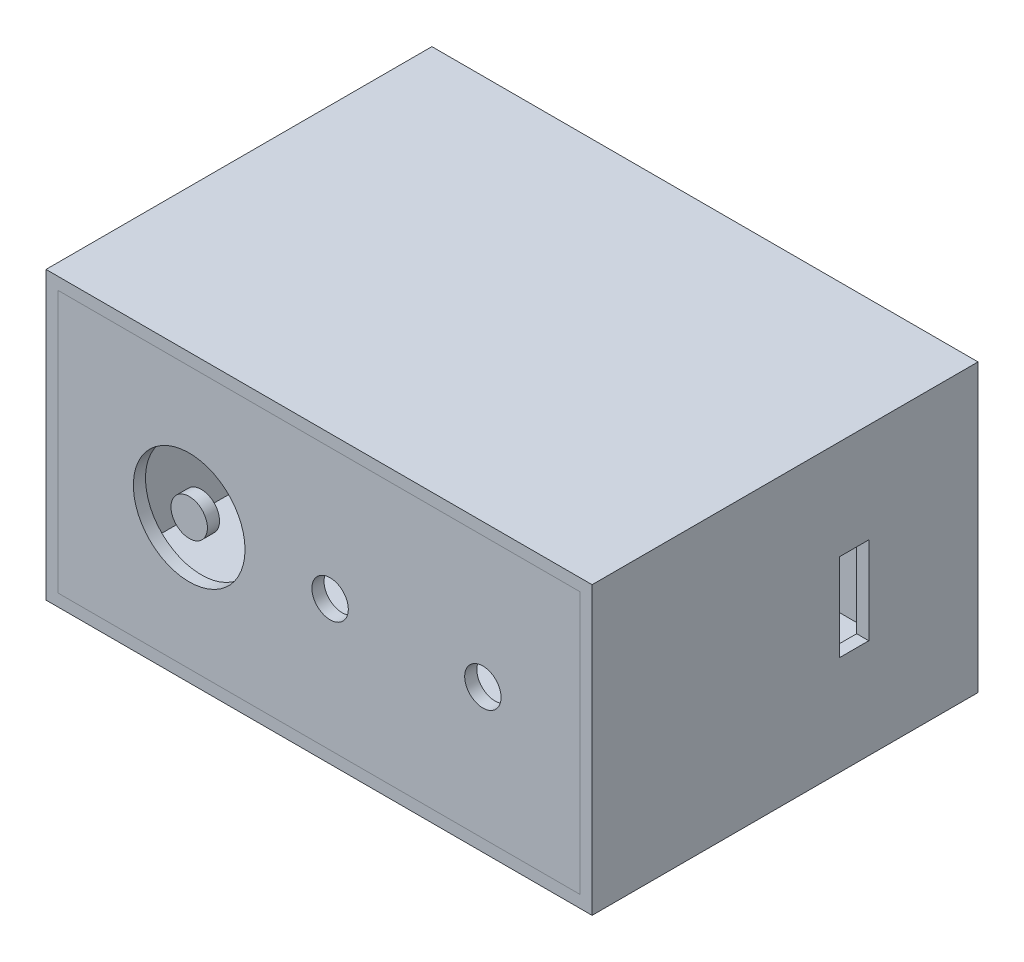
ISO-10303-21;
HEADER;
FILE_DESCRIPTION(('STEP AP214'),'2;1');
FILE_NAME('part.step','',(''),(''),'','','');
FILE_SCHEMA(('AUTOMOTIVE_DESIGN { 1 0 10303 214 1 1 1 1 }'));
ENDSEC;
DATA;
#1=APPLICATION_CONTEXT('core data for automotive mechanical design processes');
#2=APPLICATION_PROTOCOL_DEFINITION('international standard','automotive_design',2000,#1);
#3=PRODUCT_CONTEXT('',#1,'mechanical');
#4=PRODUCT('Part','Part','',(#3));
#5=PRODUCT_RELATED_PRODUCT_CATEGORY('part','',(#4));
#6=PRODUCT_DEFINITION_FORMATION('','',#4);
#7=PRODUCT_DEFINITION_CONTEXT('part definition',#1,'design');
#8=PRODUCT_DEFINITION('design','',#6,#7);
#9=PRODUCT_DEFINITION_SHAPE('','',#8);
#10=(LENGTH_UNIT() NAMED_UNIT(*) SI_UNIT(.MILLI.,.METRE.));
#11=(NAMED_UNIT(*) PLANE_ANGLE_UNIT() SI_UNIT($,.RADIAN.));
#12=(NAMED_UNIT(*) SI_UNIT($,.STERADIAN.) SOLID_ANGLE_UNIT());
#13=UNCERTAINTY_MEASURE_WITH_UNIT(LENGTH_MEASURE(1.E-05),#10,'distance_accuracy_value','');
#14=(GEOMETRIC_REPRESENTATION_CONTEXT(3) GLOBAL_UNCERTAINTY_ASSIGNED_CONTEXT((#13)) GLOBAL_UNIT_ASSIGNED_CONTEXT((#10,
#11,#12)) REPRESENTATION_CONTEXT('',''));
#15=CARTESIAN_POINT('',(0.,0.,0.));
#16=DIRECTION('',(0.,0.,1.));
#17=DIRECTION('',(1.,0.,0.));
#18=AXIS2_PLACEMENT_3D('',#15,#16,#17);
#19=CARTESIAN_POINT('',(0.,0.,15.4));
#20=DIRECTION('',(0.,0.,-1.));
#21=DIRECTION('',(-1.,0.,0.));
#22=AXIS2_PLACEMENT_3D('',#19,#20,#21);
#23=PLANE('',#22);
#24=CARTESIAN_POINT('',(-5.35,0.,15.4));
#25=DIRECTION('',(0.,0.,1.));
#26=DIRECTION('',(1.,0.,0.));
#27=AXIS2_PLACEMENT_3D('',#24,#25,#26);
#28=CIRCLE('',#27,0.750000000000002);
#29=CARTESIAN_POINT('',(-4.6,0.,15.4));
#30=VERTEX_POINT('',#29);
#31=EDGE_CURVE('P0_E18',#30,#30,#28,.T.);
#32=ORIENTED_EDGE('',*,*,#31,.F.);
#33=EDGE_LOOP('',(#32));
#34=FACE_BOUND('',#33,.T.);
#35=ADVANCED_FACE('P0_F15',(#34),#23,.T.);
#36=CARTESIAN_POINT('',(-5.35,0.,15.4));
#37=DIRECTION('',(0.,0.,1.));
#38=DIRECTION('',(1.,0.,0.));
#39=AXIS2_PLACEMENT_3D('',#36,#37,#38);
#40=CYLINDRICAL_SURFACE('',#39,0.750000000000002);
#41=CARTESIAN_POINT('',(-5.35,0.,15.9));
#42=DIRECTION('',(0.,0.,1.));
#43=DIRECTION('',(1.,0.,0.));
#44=AXIS2_PLACEMENT_3D('',#41,#42,#43);
#45=CIRCLE('',#44,0.750000000000002);
#46=CARTESIAN_POINT('',(-4.6,0.,15.9));
#47=VERTEX_POINT('',#46);
#48=EDGE_CURVE('P0_E10',#47,#47,#45,.F.);
#49=ORIENTED_EDGE('',*,*,#48,.T.);
#50=EDGE_LOOP('',(#49));
#51=FACE_BOUND('',#50,.T.);
#52=ORIENTED_EDGE('',*,*,#31,.T.);
#53=EDGE_LOOP('',(#52));
#54=FACE_BOUND('',#53,.T.);
#55=ADVANCED_FACE('P0_F27',(#51,#54),#40,.T.);
#56=CARTESIAN_POINT('',(0.,0.,15.9));
#57=DIRECTION('',(0.,0.,-1.));
#58=DIRECTION('',(-1.,0.,0.));
#59=AXIS2_PLACEMENT_3D('',#56,#57,#58);
#60=PLANE('',#59);
#61=ORIENTED_EDGE('',*,*,#48,.F.);
#62=EDGE_LOOP('',(#61));
#63=FACE_BOUND('',#62,.T.);
#64=ADVANCED_FACE('P0_F34',(#63),#60,.F.);
#65=CLOSED_SHELL('',(#35,#55,#64));
#66=MANIFOLD_SOLID_BREP('P0_B1',#65);
#67=CARTESIAN_POINT('',(0.,0.,15.9));
#68=DIRECTION('',(0.,0.,-1.));
#69=DIRECTION('',(-1.,0.,0.));
#70=AXIS2_PLACEMENT_3D('',#67,#68,#69);
#71=PLANE('',#70);
#72=DIRECTION('',(1.,0.,0.));
#73=VECTOR('',#72,1.);
#74=CARTESIAN_POINT('',(-10.75,5.4,15.9));
#75=LINE('',#74,#73);
#76=CARTESIAN_POINT('',(-10.75,5.4,15.9));
#77=VERTEX_POINT('',#76);
#78=CARTESIAN_POINT('',(10.75,5.4,15.9));
#79=VERTEX_POINT('',#78);
#80=EDGE_CURVE('P1_E208',#77,#79,#75,.T.);
#81=ORIENTED_EDGE('',*,*,#80,.F.);
#82=DIRECTION('',(0.,1.,0.));
#83=VECTOR('',#82,1.);
#84=CARTESIAN_POINT('',(-10.75,-5.4,15.9));
#85=LINE('',#84,#83);
#86=CARTESIAN_POINT('',(-10.75,-5.4,15.9));
#87=VERTEX_POINT('',#86);
#88=EDGE_CURVE('P1_E55',#87,#77,#85,.T.);
#89=ORIENTED_EDGE('',*,*,#88,.F.);
#90=DIRECTION('',(1.,0.,0.));
#91=VECTOR('',#90,1.);
#92=CARTESIAN_POINT('',(-10.75,-5.4,15.9));
#93=LINE('',#92,#91);
#94=CARTESIAN_POINT('',(10.75,-5.4,15.9));
#95=VERTEX_POINT('',#94);
#96=EDGE_CURVE('P1_E57',#95,#87,#93,.F.);
#97=ORIENTED_EDGE('',*,*,#96,.F.);
#98=DIRECTION('',(0.,1.,0.));
#99=VECTOR('',#98,1.);
#100=CARTESIAN_POINT('',(10.75,-5.4,15.9));
#101=LINE('',#100,#99);
#102=EDGE_CURVE('P1_E60',#79,#95,#101,.F.);
#103=ORIENTED_EDGE('',*,*,#102,.F.);
#104=EDGE_LOOP('',(#81,#89,#97,#103));
#105=FACE_BOUND('',#104,.T.);
#106=CARTESIAN_POINT('',(6.75,0.,15.9));
#107=DIRECTION('',(0.,0.,1.));
#108=DIRECTION('',(1.,0.,0.));
#109=AXIS2_PLACEMENT_3D('',#106,#107,#108);
#110=CIRCLE('',#109,0.749999999999999);
#111=CARTESIAN_POINT('',(7.5,0.,15.9));
#112=VERTEX_POINT('',#111);
#113=EDGE_CURVE('P1_E73',#112,#112,#110,.F.);
#114=ORIENTED_EDGE('',*,*,#113,.T.);
#115=EDGE_LOOP('',(#114));
#116=FACE_BOUND('',#115,.T.);
#117=CARTESIAN_POINT('',(-5.35,0.,15.9));
#118=DIRECTION('',(0.,0.,1.));
#119=DIRECTION('',(1.,0.,0.));
#120=AXIS2_PLACEMENT_3D('',#117,#118,#119);
#121=CIRCLE('',#120,2.29999999999999);
#122=CARTESIAN_POINT('',(-3.05000000000001,0.,15.9));
#123=VERTEX_POINT('',#122);
#124=EDGE_CURVE('P1_E95',#123,#123,#121,.F.);
#125=ORIENTED_EDGE('',*,*,#124,.T.);
#126=EDGE_LOOP('',(#125));
#127=FACE_BOUND('',#126,.T.);
#128=CARTESIAN_POINT('',(0.455450907590688,0.,15.9));
#129=DIRECTION('',(0.,0.,1.));
#130=DIRECTION('',(1.,0.,0.));
#131=AXIS2_PLACEMENT_3D('',#128,#129,#130);
#132=CIRCLE('',#131,0.75);
#133=CARTESIAN_POINT('',(1.20545090759069,0.,15.9));
#134=VERTEX_POINT('',#133);
#135=EDGE_CURVE('P1_E20',#134,#134,#132,.F.);
#136=ORIENTED_EDGE('',*,*,#135,.T.);
#137=EDGE_LOOP('',(#136));
#138=FACE_BOUND('',#137,.T.);
#139=ADVANCED_FACE('P1_F17',(#105,#116,#127,#138),#71,.F.);
#140=CARTESIAN_POINT('',(0.455450907590688,0.,15.4));
#141=DIRECTION('',(0.,0.,1.));
#142=DIRECTION('',(1.,0.,0.));
#143=AXIS2_PLACEMENT_3D('',#140,#141,#142);
#144=CYLINDRICAL_SURFACE('',#143,0.75);
#145=ORIENTED_EDGE('',*,*,#135,.F.);
#146=EDGE_LOOP('',(#145));
#147=FACE_BOUND('',#146,.T.);
#148=CARTESIAN_POINT('',(0.455450907590688,0.,15.4));
#149=DIRECTION('',(0.,0.,1.));
#150=DIRECTION('',(1.,0.,0.));
#151=AXIS2_PLACEMENT_3D('',#148,#149,#150);
#152=CIRCLE('',#151,0.75);
#153=CARTESIAN_POINT('',(1.20545090759069,0.,15.4));
#154=VERTEX_POINT('',#153);
#155=EDGE_CURVE('P1_E91',#154,#154,#152,.T.);
#156=ORIENTED_EDGE('',*,*,#155,.F.);
#157=EDGE_LOOP('',(#156));
#158=FACE_BOUND('',#157,.T.);
#159=ADVANCED_FACE('P1_F103',(#147,#158),#144,.F.);
#160=CARTESIAN_POINT('',(-5.35,0.,15.4));
#161=DIRECTION('',(0.,0.,1.));
#162=DIRECTION('',(1.,0.,0.));
#163=AXIS2_PLACEMENT_3D('',#160,#161,#162);
#164=CYLINDRICAL_SURFACE('',#163,2.29999999999999);
#165=ORIENTED_EDGE('',*,*,#124,.F.);
#166=EDGE_LOOP('',(#165));
#167=FACE_BOUND('',#166,.T.);
#168=CARTESIAN_POINT('',(-5.35,0.,15.4));
#169=DIRECTION('',(0.,0.,1.));
#170=DIRECTION('',(1.,0.,0.));
#171=AXIS2_PLACEMENT_3D('',#168,#169,#170);
#172=CIRCLE('',#171,2.29999999999999);
#173=CARTESIAN_POINT('',(-3.05000000000001,0.,15.4));
#174=VERTEX_POINT('',#173);
#175=EDGE_CURVE('P1_E88',#174,#174,#172,.T.);
#176=ORIENTED_EDGE('',*,*,#175,.F.);
#177=EDGE_LOOP('',(#176));
#178=FACE_BOUND('',#177,.T.);
#179=ADVANCED_FACE('P1_F106',(#167,#178),#164,.F.);
#180=CARTESIAN_POINT('',(6.75,0.,15.4));
#181=DIRECTION('',(0.,0.,1.));
#182=DIRECTION('',(1.,0.,0.));
#183=AXIS2_PLACEMENT_3D('',#180,#181,#182);
#184=CYLINDRICAL_SURFACE('',#183,0.749999999999999);
#185=ORIENTED_EDGE('',*,*,#113,.F.);
#186=EDGE_LOOP('',(#185));
#187=FACE_BOUND('',#186,.T.);
#188=CARTESIAN_POINT('',(6.75,0.,15.4));
#189=DIRECTION('',(0.,0.,1.));
#190=DIRECTION('',(1.,0.,0.));
#191=AXIS2_PLACEMENT_3D('',#188,#189,#190);
#192=CIRCLE('',#191,0.749999999999999);
#193=CARTESIAN_POINT('',(7.5,0.,15.4));
#194=VERTEX_POINT('',#193);
#195=EDGE_CURVE('P1_E84',#194,#194,#192,.T.);
#196=ORIENTED_EDGE('',*,*,#195,.F.);
#197=EDGE_LOOP('',(#196));
#198=FACE_BOUND('',#197,.T.);
#199=ADVANCED_FACE('P1_F130',(#187,#198),#184,.F.);
#200=CARTESIAN_POINT('',(10.75,-5.4,15.4));
#201=DIRECTION('',(1.,0.,0.));
#202=DIRECTION('',(0.,0.,-1.));
#203=AXIS2_PLACEMENT_3D('',#200,#201,#202);
#204=PLANE('',#203);
#205=DIRECTION('',(0.,1.,0.));
#206=VECTOR('',#205,1.);
#207=CARTESIAN_POINT('',(10.75,0.,15.4));
#208=LINE('',#207,#206);
#209=CARTESIAN_POINT('',(10.75,5.4,15.4));
#210=VERTEX_POINT('',#209);
#211=CARTESIAN_POINT('',(10.75,-5.4,15.4));
#212=VERTEX_POINT('',#211);
#213=EDGE_CURVE('P1_E87',#210,#212,#208,.F.);
#214=ORIENTED_EDGE('',*,*,#213,.F.);
#215=DIRECTION('',(0.,0.,1.));
#216=VECTOR('',#215,1.);
#217=CARTESIAN_POINT('',(10.75,5.4,15.4));
#218=LINE('',#217,#216);
#219=EDGE_CURVE('P1_E71',#79,#210,#218,.F.);
#220=ORIENTED_EDGE('',*,*,#219,.F.);
#221=ORIENTED_EDGE('',*,*,#102,.T.);
#222=DIRECTION('',(0.,0.,-1.));
#223=VECTOR('',#222,1.);
#224=CARTESIAN_POINT('',(10.75,-5.4,15.4));
#225=LINE('',#224,#223);
#226=EDGE_CURVE('P1_E65',#212,#95,#225,.F.);
#227=ORIENTED_EDGE('',*,*,#226,.F.);
#228=EDGE_LOOP('',(#214,#220,#221,#227));
#229=FACE_BOUND('',#228,.T.);
#230=ADVANCED_FACE('P1_F68',(#229),#204,.T.);
#231=CARTESIAN_POINT('',(-10.75,-5.4,15.4));
#232=DIRECTION('',(0.,-1.,0.));
#233=DIRECTION('',(0.,0.,-1.));
#234=AXIS2_PLACEMENT_3D('',#231,#232,#233);
#235=PLANE('',#234);
#236=DIRECTION('',(-1.,0.,0.));
#237=VECTOR('',#236,1.);
#238=CARTESIAN_POINT('',(0.,-5.4,15.4));
#239=LINE('',#238,#237);
#240=CARTESIAN_POINT('',(-10.75,-5.4,15.4));
#241=VERTEX_POINT('',#240);
#242=EDGE_CURVE('P1_E77',#212,#241,#239,.T.);
#243=ORIENTED_EDGE('',*,*,#242,.F.);
#244=ORIENTED_EDGE('',*,*,#226,.T.);
#245=ORIENTED_EDGE('',*,*,#96,.T.);
#246=DIRECTION('',(0.,0.,1.));
#247=VECTOR('',#246,1.);
#248=CARTESIAN_POINT('',(-10.75,-5.4,15.4));
#249=LINE('',#248,#247);
#250=EDGE_CURVE('P1_E80',#241,#87,#249,.T.);
#251=ORIENTED_EDGE('',*,*,#250,.F.);
#252=EDGE_LOOP('',(#243,#244,#245,#251));
#253=FACE_BOUND('',#252,.T.);
#254=ADVANCED_FACE('P1_F75',(#253),#235,.T.);
#255=CARTESIAN_POINT('',(-10.75,-5.4,15.4));
#256=DIRECTION('',(-1.,0.,0.));
#257=DIRECTION('',(0.,0.,1.));
#258=AXIS2_PLACEMENT_3D('',#255,#256,#257);
#259=PLANE('',#258);
#260=DIRECTION('',(0.,1.,0.));
#261=VECTOR('',#260,1.);
#262=CARTESIAN_POINT('',(-10.75,0.,15.4));
#263=LINE('',#262,#261);
#264=CARTESIAN_POINT('',(-10.75,5.4,15.4));
#265=VERTEX_POINT('',#264);
#266=EDGE_CURVE('P1_E26',#241,#265,#263,.T.);
#267=ORIENTED_EDGE('',*,*,#266,.F.);
#268=ORIENTED_EDGE('',*,*,#250,.T.);
#269=ORIENTED_EDGE('',*,*,#88,.T.);
#270=DIRECTION('',(0.,0.,1.));
#271=VECTOR('',#270,1.);
#272=CARTESIAN_POINT('',(-10.75,5.4,15.4));
#273=LINE('',#272,#271);
#274=EDGE_CURVE('P1_E35',#265,#77,#273,.T.);
#275=ORIENTED_EDGE('',*,*,#274,.F.);
#276=EDGE_LOOP('',(#267,#268,#269,#275));
#277=FACE_BOUND('',#276,.T.);
#278=ADVANCED_FACE('P1_F118',(#277),#259,.T.);
#279=CARTESIAN_POINT('',(-10.75,5.4,15.4));
#280=DIRECTION('',(0.,1.,0.));
#281=DIRECTION('',(0.,0.,1.));
#282=AXIS2_PLACEMENT_3D('',#279,#280,#281);
#283=PLANE('',#282);
#284=DIRECTION('',(-1.,0.,0.));
#285=VECTOR('',#284,1.);
#286=CARTESIAN_POINT('',(0.,5.4,15.4));
#287=LINE('',#286,#285);
#288=EDGE_CURVE('P1_E11',#265,#210,#287,.F.);
#289=ORIENTED_EDGE('',*,*,#288,.F.);
#290=ORIENTED_EDGE('',*,*,#274,.T.);
#291=ORIENTED_EDGE('',*,*,#80,.T.);
#292=ORIENTED_EDGE('',*,*,#219,.T.);
#293=EDGE_LOOP('',(#289,#290,#291,#292));
#294=FACE_BOUND('',#293,.T.);
#295=ADVANCED_FACE('P1_F111',(#294),#283,.T.);
#296=CARTESIAN_POINT('',(0.,0.,15.4));
#297=DIRECTION('',(0.,0.,-1.));
#298=DIRECTION('',(-1.,0.,0.));
#299=AXIS2_PLACEMENT_3D('',#296,#297,#298);
#300=PLANE('',#299);
#301=ORIENTED_EDGE('',*,*,#266,.T.);
#302=ORIENTED_EDGE('',*,*,#288,.T.);
#303=ORIENTED_EDGE('',*,*,#213,.T.);
#304=ORIENTED_EDGE('',*,*,#242,.T.);
#305=EDGE_LOOP('',(#301,#302,#303,#304));
#306=FACE_BOUND('',#305,.T.);
#307=ORIENTED_EDGE('',*,*,#195,.T.);
#308=EDGE_LOOP('',(#307));
#309=FACE_BOUND('',#308,.T.);
#310=ORIENTED_EDGE('',*,*,#175,.T.);
#311=EDGE_LOOP('',(#310));
#312=FACE_BOUND('',#311,.T.);
#313=ORIENTED_EDGE('',*,*,#155,.T.);
#314=EDGE_LOOP('',(#313));
#315=FACE_BOUND('',#314,.T.);
#316=ADVANCED_FACE('P1_F109',(#306,#309,#312,#315),#300,.T.);
#317=CLOSED_SHELL('',(#139,#159,#179,#199,#230,#254,#278,#295,#316));
#318=MANIFOLD_SOLID_BREP('P1_B1',#317);
#319=CARTESIAN_POINT('',(0.,0.,0.5));
#320=DIRECTION('',(0.,0.,-1.));
#321=DIRECTION('',(-1.,0.,0.));
#322=AXIS2_PLACEMENT_3D('',#319,#320,#321);
#323=PLANE('',#322);
#324=DIRECTION('',(1.,0.,0.));
#325=VECTOR('',#324,1.);
#326=CARTESIAN_POINT('',(-11.25,5.4,0.5));
#327=LINE('',#326,#325);
#328=CARTESIAN_POINT('',(-10.75,5.4,0.5));
#329=VERTEX_POINT('',#328);
#330=CARTESIAN_POINT('',(10.75,5.4,0.5));
#331=VERTEX_POINT('',#330);
#332=EDGE_CURVE('P2_E116',#329,#331,#327,.T.);
#333=ORIENTED_EDGE('',*,*,#332,.F.);
#334=DIRECTION('',(0.,1.,0.));
#335=VECTOR('',#334,1.);
#336=CARTESIAN_POINT('',(-10.75,-5.9,0.5));
#337=LINE('',#336,#335);
#338=CARTESIAN_POINT('',(-10.75,-5.4,0.5));
#339=VERTEX_POINT('',#338);
#340=EDGE_CURVE('P2_E107',#339,#329,#337,.T.);
#341=ORIENTED_EDGE('',*,*,#340,.F.);
#342=DIRECTION('',(1.,0.,0.));
#343=VECTOR('',#342,1.);
#344=CARTESIAN_POINT('',(-11.25,-5.4,0.5));
#345=LINE('',#344,#343);
#346=CARTESIAN_POINT('',(10.75,-5.4,0.5));
#347=VERTEX_POINT('',#346);
#348=EDGE_CURVE('P2_E102',#347,#339,#345,.F.);
#349=ORIENTED_EDGE('',*,*,#348,.F.);
#350=DIRECTION('',(0.,1.,0.));
#351=VECTOR('',#350,1.);
#352=CARTESIAN_POINT('',(10.75,-5.9,0.5));
#353=LINE('',#352,#351);
#354=EDGE_CURVE('P2_E119',#331,#347,#353,.F.);
#355=ORIENTED_EDGE('',*,*,#354,.F.);
#356=EDGE_LOOP('',(#333,#341,#349,#355));
#357=FACE_BOUND('',#356,.T.);
#358=ADVANCED_FACE('P2_F17',(#357),#323,.F.);
#359=CARTESIAN_POINT('',(6.35,-1.8,5.7));
#360=DIRECTION('',(0.,0.,1.));
#361=DIRECTION('',(1.,0.,0.));
#362=AXIS2_PLACEMENT_3D('',#359,#360,#361);
#363=PLANE('',#362);
#364=DIRECTION('',(1.,0.,0.));
#365=VECTOR('',#364,1.);
#366=CARTESIAN_POINT('',(6.35,1.8,5.7));
#367=LINE('',#366,#365);
#368=CARTESIAN_POINT('',(10.75,1.8,5.7));
#369=VERTEX_POINT('',#368);
#370=CARTESIAN_POINT('',(11.25,1.8,5.7));
#371=VERTEX_POINT('',#370);
#372=EDGE_CURVE('P2_E134',#369,#371,#367,.T.);
#373=ORIENTED_EDGE('',*,*,#372,.T.);
#374=DIRECTION('',(0.,1.,0.));
#375=VECTOR('',#374,1.);
#376=CARTESIAN_POINT('',(11.25,-5.9,5.7));
#377=LINE('',#376,#375);
#378=CARTESIAN_POINT('',(11.25,-1.8,5.7));
#379=VERTEX_POINT('',#378);
#380=EDGE_CURVE('P2_E147',#371,#379,#377,.F.);
#381=ORIENTED_EDGE('',*,*,#380,.T.);
#382=DIRECTION('',(1.,0.,0.));
#383=VECTOR('',#382,1.);
#384=CARTESIAN_POINT('',(6.35,-1.8,5.7));
#385=LINE('',#384,#383);
#386=CARTESIAN_POINT('',(10.75,-1.8,5.7));
#387=VERTEX_POINT('',#386);
#388=EDGE_CURVE('P2_E20',#379,#387,#385,.F.);
#389=ORIENTED_EDGE('',*,*,#388,.T.);
#390=DIRECTION('',(0.,1.,0.));
#391=VECTOR('',#390,1.);
#392=CARTESIAN_POINT('',(10.75,-5.9,5.7));
#393=LINE('',#392,#391);
#394=EDGE_CURVE('P2_E146',#369,#387,#393,.F.);
#395=ORIENTED_EDGE('',*,*,#394,.F.);
#396=EDGE_LOOP('',(#373,#381,#389,#395));
#397=FACE_BOUND('',#396,.T.);
#398=ADVANCED_FACE('P2_F145',(#397),#363,.F.);
#399=CARTESIAN_POINT('',(6.35,-1.8,5.7));
#400=DIRECTION('',(0.,-1.,0.));
#401=DIRECTION('',(0.,0.,-1.));
#402=AXIS2_PLACEMENT_3D('',#399,#400,#401);
#403=PLANE('',#402);
#404=ORIENTED_EDGE('',*,*,#388,.F.);
#405=DIRECTION('',(0.,0.,1.));
#406=VECTOR('',#405,1.);
#407=CARTESIAN_POINT('',(11.25,-1.8,15.9));
#408=LINE('',#407,#406);
#409=CARTESIAN_POINT('',(11.25,-1.8,4.5));
#410=VERTEX_POINT('',#409);
#411=EDGE_CURVE('P2_E193',#379,#410,#408,.F.);
#412=ORIENTED_EDGE('',*,*,#411,.T.);
#413=DIRECTION('',(-1.,0.,0.));
#414=VECTOR('',#413,1.);
#415=CARTESIAN_POINT('',(6.35,-1.8,4.5));
#416=LINE('',#415,#414);
#417=CARTESIAN_POINT('',(10.75,-1.8,4.5));
#418=VERTEX_POINT('',#417);
#419=EDGE_CURVE('P2_E136',#410,#418,#416,.T.);
#420=ORIENTED_EDGE('',*,*,#419,.T.);
#421=DIRECTION('',(0.,0.,1.));
#422=VECTOR('',#421,1.);
#423=CARTESIAN_POINT('',(10.75,-1.8,15.9));
#424=LINE('',#423,#422);
#425=EDGE_CURVE('P2_E149',#387,#418,#424,.F.);
#426=ORIENTED_EDGE('',*,*,#425,.F.);
#427=EDGE_LOOP('',(#404,#412,#420,#426));
#428=FACE_BOUND('',#427,.T.);
#429=ADVANCED_FACE('P2_F150',(#428),#403,.F.);
#430=CARTESIAN_POINT('',(6.35,-1.8,4.5));
#431=DIRECTION('',(0.,0.,-1.));
#432=DIRECTION('',(-1.,0.,0.));
#433=AXIS2_PLACEMENT_3D('',#430,#431,#432);
#434=PLANE('',#433);
#435=ORIENTED_EDGE('',*,*,#419,.F.);
#436=DIRECTION('',(0.,1.,0.));
#437=VECTOR('',#436,1.);
#438=CARTESIAN_POINT('',(11.25,-5.9,4.5));
#439=LINE('',#438,#437);
#440=CARTESIAN_POINT('',(11.25,1.8,4.5));
#441=VERTEX_POINT('',#440);
#442=EDGE_CURVE('P2_E190',#410,#441,#439,.T.);
#443=ORIENTED_EDGE('',*,*,#442,.T.);
#444=DIRECTION('',(1.,0.,0.));
#445=VECTOR('',#444,1.);
#446=CARTESIAN_POINT('',(6.35,1.8,4.5));
#447=LINE('',#446,#445);
#448=CARTESIAN_POINT('',(10.75,1.8,4.5));
#449=VERTEX_POINT('',#448);
#450=EDGE_CURVE('P2_E123',#441,#449,#447,.F.);
#451=ORIENTED_EDGE('',*,*,#450,.T.);
#452=DIRECTION('',(0.,1.,0.));
#453=VECTOR('',#452,1.);
#454=CARTESIAN_POINT('',(10.75,-5.9,4.5));
#455=LINE('',#454,#453);
#456=EDGE_CURVE('P2_E162',#418,#449,#455,.T.);
#457=ORIENTED_EDGE('',*,*,#456,.F.);
#458=EDGE_LOOP('',(#435,#443,#451,#457));
#459=FACE_BOUND('',#458,.T.);
#460=ADVANCED_FACE('P2_F261',(#459),#434,.F.);
#461=CARTESIAN_POINT('',(6.35,1.8,5.7));
#462=DIRECTION('',(0.,1.,0.));
#463=DIRECTION('',(0.,0.,1.));
#464=AXIS2_PLACEMENT_3D('',#461,#462,#463);
#465=PLANE('',#464);
#466=ORIENTED_EDGE('',*,*,#450,.F.);
#467=DIRECTION('',(0.,0.,1.));
#468=VECTOR('',#467,1.);
#469=CARTESIAN_POINT('',(11.25,1.8,15.9));
#470=LINE('',#469,#468);
#471=EDGE_CURVE('P2_E187',#441,#371,#470,.T.);
#472=ORIENTED_EDGE('',*,*,#471,.T.);
#473=ORIENTED_EDGE('',*,*,#372,.F.);
#474=DIRECTION('',(0.,0.,1.));
#475=VECTOR('',#474,1.);
#476=CARTESIAN_POINT('',(10.75,1.8,15.9));
#477=LINE('',#476,#475);
#478=EDGE_CURVE('P2_E156',#449,#369,#477,.T.);
#479=ORIENTED_EDGE('',*,*,#478,.F.);
#480=EDGE_LOOP('',(#466,#472,#473,#479));
#481=FACE_BOUND('',#480,.T.);
#482=ADVANCED_FACE('P2_F258',(#481),#465,.F.);
#483=CARTESIAN_POINT('',(-11.25,5.4,15.9));
#484=DIRECTION('',(0.,-1.,0.));
#485=DIRECTION('',(0.,0.,-1.));
#486=AXIS2_PLACEMENT_3D('',#483,#484,#485);
#487=PLANE('',#486);
#488=DIRECTION('',(-1.,0.,0.));
#489=VECTOR('',#488,1.);
#490=CARTESIAN_POINT('',(0.,5.4,15.9));
#491=LINE('',#490,#489);
#492=CARTESIAN_POINT('',(10.75,5.4,15.9));
#493=VERTEX_POINT('',#492);
#494=CARTESIAN_POINT('',(-10.75,5.4,15.9));
#495=VERTEX_POINT('',#494);
#496=EDGE_CURVE('P2_E127',#493,#495,#491,.T.);
#497=ORIENTED_EDGE('',*,*,#496,.T.);
#498=DIRECTION('',(0.,0.,-1.));
#499=VECTOR('',#498,1.);
#500=CARTESIAN_POINT('',(-10.75,5.4,15.9));
#501=LINE('',#500,#499);
#502=EDGE_CURVE('P2_E112',#329,#495,#501,.F.);
#503=ORIENTED_EDGE('',*,*,#502,.F.);
#504=ORIENTED_EDGE('',*,*,#332,.T.);
#505=DIRECTION('',(0.,0.,1.));
#506=VECTOR('',#505,1.);
#507=CARTESIAN_POINT('',(10.75,5.4,15.9));
#508=LINE('',#507,#506);
#509=EDGE_CURVE('P2_E196',#493,#331,#508,.F.);
#510=ORIENTED_EDGE('',*,*,#509,.F.);
#511=EDGE_LOOP('',(#497,#503,#504,#510));
#512=FACE_BOUND('',#511,.T.);
#513=ADVANCED_FACE('P2_F126',(#512),#487,.T.);
#514=CARTESIAN_POINT('',(-10.75,-5.9,15.9));
#515=DIRECTION('',(1.,0.,0.));
#516=DIRECTION('',(0.,0.,-1.));
#517=AXIS2_PLACEMENT_3D('',#514,#515,#516);
#518=PLANE('',#517);
#519=DIRECTION('',(0.,1.,0.));
#520=VECTOR('',#519,1.);
#521=CARTESIAN_POINT('',(-10.75,0.,15.9));
#522=LINE('',#521,#520);
#523=CARTESIAN_POINT('',(-10.75,-5.4,15.9));
#524=VERTEX_POINT('',#523);
#525=EDGE_CURVE('P2_E171',#495,#524,#522,.F.);
#526=ORIENTED_EDGE('',*,*,#525,.T.);
#527=DIRECTION('',(0.,0.,1.));
#528=VECTOR('',#527,1.);
#529=CARTESIAN_POINT('',(-10.75,-5.4,15.9));
#530=LINE('',#529,#528);
#531=EDGE_CURVE('P2_E114',#339,#524,#530,.T.);
#532=ORIENTED_EDGE('',*,*,#531,.F.);
#533=ORIENTED_EDGE('',*,*,#340,.T.);
#534=ORIENTED_EDGE('',*,*,#502,.T.);
#535=EDGE_LOOP('',(#526,#532,#533,#534));
#536=FACE_BOUND('',#535,.T.);
#537=ADVANCED_FACE('P2_F110',(#536),#518,.T.);
#538=CARTESIAN_POINT('',(-11.25,-5.4,15.9));
#539=DIRECTION('',(0.,1.,0.));
#540=DIRECTION('',(0.,0.,1.));
#541=AXIS2_PLACEMENT_3D('',#538,#539,#540);
#542=PLANE('',#541);
#543=DIRECTION('',(-1.,0.,0.));
#544=VECTOR('',#543,1.);
#545=CARTESIAN_POINT('',(0.,-5.4,15.9));
#546=LINE('',#545,#544);
#547=CARTESIAN_POINT('',(10.75,-5.4,15.9));
#548=VERTEX_POINT('',#547);
#549=EDGE_CURVE('P2_E166',#524,#548,#546,.F.);
#550=ORIENTED_EDGE('',*,*,#549,.T.);
#551=DIRECTION('',(0.,0.,1.));
#552=VECTOR('',#551,1.);
#553=CARTESIAN_POINT('',(10.75,-5.4,15.9));
#554=LINE('',#553,#552);
#555=EDGE_CURVE('P2_E154',#347,#548,#554,.T.);
#556=ORIENTED_EDGE('',*,*,#555,.F.);
#557=ORIENTED_EDGE('',*,*,#348,.T.);
#558=ORIENTED_EDGE('',*,*,#531,.T.);
#559=EDGE_LOOP('',(#550,#556,#557,#558));
#560=FACE_BOUND('',#559,.T.);
#561=ADVANCED_FACE('P2_F165',(#560),#542,.T.);
#562=CARTESIAN_POINT('',(10.75,-5.9,15.9));
#563=DIRECTION('',(-1.,0.,0.));
#564=DIRECTION('',(0.,0.,1.));
#565=AXIS2_PLACEMENT_3D('',#562,#563,#564);
#566=PLANE('',#565);
#567=DIRECTION('',(0.,1.,0.));
#568=VECTOR('',#567,1.);
#569=CARTESIAN_POINT('',(10.75,0.,15.9));
#570=LINE('',#569,#568);
#571=EDGE_CURVE('P2_E173',#548,#493,#570,.T.);
#572=ORIENTED_EDGE('',*,*,#571,.T.);
#573=ORIENTED_EDGE('',*,*,#509,.T.);
#574=ORIENTED_EDGE('',*,*,#354,.T.);
#575=ORIENTED_EDGE('',*,*,#555,.T.);
#576=EDGE_LOOP('',(#572,#573,#574,#575));
#577=FACE_BOUND('',#576,.T.);
#578=ORIENTED_EDGE('',*,*,#394,.T.);
#579=ORIENTED_EDGE('',*,*,#425,.T.);
#580=ORIENTED_EDGE('',*,*,#456,.T.);
#581=ORIENTED_EDGE('',*,*,#478,.T.);
#582=EDGE_LOOP('',(#578,#579,#580,#581));
#583=FACE_BOUND('',#582,.T.);
#584=ADVANCED_FACE('P2_F198',(#577,#583),#566,.T.);
#585=CARTESIAN_POINT('',(-11.25,-5.9,15.9));
#586=DIRECTION('',(0.,1.,0.));
#587=DIRECTION('',(0.,0.,1.));
#588=AXIS2_PLACEMENT_3D('',#585,#586,#587);
#589=PLANE('',#588);
#590=DIRECTION('',(0.,0.,1.));
#591=VECTOR('',#590,1.);
#592=CARTESIAN_POINT('',(11.25,-5.9,15.9));
#593=LINE('',#592,#591);
#594=CARTESIAN_POINT('',(11.25,-5.9,0.));
#595=VERTEX_POINT('',#594);
#596=CARTESIAN_POINT('',(11.25,-5.9,15.9));
#597=VERTEX_POINT('',#596);
#598=EDGE_CURVE('P2_E184',#595,#597,#593,.T.);
#599=ORIENTED_EDGE('',*,*,#598,.T.);
#600=DIRECTION('',(-1.,0.,0.));
#601=VECTOR('',#600,1.);
#602=CARTESIAN_POINT('',(0.,-5.9,15.9));
#603=LINE('',#602,#601);
#604=CARTESIAN_POINT('',(-11.25,-5.9,15.9));
#605=VERTEX_POINT('',#604);
#606=EDGE_CURVE('P2_E182',#597,#605,#603,.T.);
#607=ORIENTED_EDGE('',*,*,#606,.T.);
#608=DIRECTION('',(0.,0.,-1.));
#609=VECTOR('',#608,1.);
#610=CARTESIAN_POINT('',(-11.25,-5.9,15.9));
#611=LINE('',#610,#609);
#612=CARTESIAN_POINT('',(-11.25,-5.9,0.));
#613=VERTEX_POINT('',#612);
#614=EDGE_CURVE('P2_E201',#605,#613,#611,.T.);
#615=ORIENTED_EDGE('',*,*,#614,.T.);
#616=DIRECTION('',(-1.,0.,0.));
#617=VECTOR('',#616,1.);
#618=CARTESIAN_POINT('',(0.,-5.9,0.));
#619=LINE('',#618,#617);
#620=EDGE_CURVE('P2_E209',#595,#613,#619,.T.);
#621=ORIENTED_EDGE('',*,*,#620,.F.);
#622=EDGE_LOOP('',(#599,#607,#615,#621));
#623=FACE_BOUND('',#622,.T.);
#624=ADVANCED_FACE('P2_F246',(#623),#589,.F.);
#625=CARTESIAN_POINT('',(11.25,-5.9,15.9));
#626=DIRECTION('',(-1.,0.,0.));
#627=DIRECTION('',(0.,0.,1.));
#628=AXIS2_PLACEMENT_3D('',#625,#626,#627);
#629=PLANE('',#628);
#630=DIRECTION('',(0.,0.,-1.));
#631=VECTOR('',#630,1.);
#632=CARTESIAN_POINT('',(11.25,5.9,15.9));
#633=LINE('',#632,#631);
#634=CARTESIAN_POINT('',(11.25,5.9,0.));
#635=VERTEX_POINT('',#634);
#636=CARTESIAN_POINT('',(11.25,5.9,15.9));
#637=VERTEX_POINT('',#636);
#638=EDGE_CURVE('P2_E212',#635,#637,#633,.F.);
#639=ORIENTED_EDGE('',*,*,#638,.T.);
#640=DIRECTION('',(0.,1.,0.));
#641=VECTOR('',#640,1.);
#642=CARTESIAN_POINT('',(11.25,0.,15.9));
#643=LINE('',#642,#641);
#644=EDGE_CURVE('P2_E176',#637,#597,#643,.F.);
#645=ORIENTED_EDGE('',*,*,#644,.T.);
#646=ORIENTED_EDGE('',*,*,#598,.F.);
#647=DIRECTION('',(0.,1.,0.));
#648=VECTOR('',#647,1.);
#649=CARTESIAN_POINT('',(11.25,0.,0.));
#650=LINE('',#649,#648);
#651=EDGE_CURVE('P2_E206',#635,#595,#650,.F.);
#652=ORIENTED_EDGE('',*,*,#651,.F.);
#653=EDGE_LOOP('',(#639,#645,#646,#652));
#654=FACE_BOUND('',#653,.T.);
#655=ORIENTED_EDGE('',*,*,#442,.F.);
#656=ORIENTED_EDGE('',*,*,#411,.F.);
#657=ORIENTED_EDGE('',*,*,#380,.F.);
#658=ORIENTED_EDGE('',*,*,#471,.F.);
#659=EDGE_LOOP('',(#655,#656,#657,#658));
#660=FACE_BOUND('',#659,.T.);
#661=ADVANCED_FACE('P2_F227',(#654,#660),#629,.F.);
#662=CARTESIAN_POINT('',(0.,0.,15.9));
#663=DIRECTION('',(0.,0.,-1.));
#664=DIRECTION('',(-1.,0.,0.));
#665=AXIS2_PLACEMENT_3D('',#662,#663,#664);
#666=PLANE('',#665);
#667=ORIENTED_EDGE('',*,*,#549,.F.);
#668=ORIENTED_EDGE('',*,*,#525,.F.);
#669=ORIENTED_EDGE('',*,*,#496,.F.);
#670=ORIENTED_EDGE('',*,*,#571,.F.);
#671=EDGE_LOOP('',(#667,#668,#669,#670));
#672=FACE_BOUND('',#671,.T.);
#673=DIRECTION('',(1.,0.,0.));
#674=VECTOR('',#673,1.);
#675=CARTESIAN_POINT('',(-11.25,5.9,15.9));
#676=LINE('',#675,#674);
#677=CARTESIAN_POINT('',(-11.25,5.9,15.9));
#678=VERTEX_POINT('',#677);
#679=EDGE_CURVE('P2_E215',#637,#678,#676,.F.);
#680=ORIENTED_EDGE('',*,*,#679,.T.);
#681=DIRECTION('',(0.,1.,0.));
#682=VECTOR('',#681,1.);
#683=CARTESIAN_POINT('',(-11.25,-5.9,15.9));
#684=LINE('',#683,#682);
#685=EDGE_CURVE('P2_E199',#678,#605,#684,.F.);
#686=ORIENTED_EDGE('',*,*,#685,.T.);
#687=ORIENTED_EDGE('',*,*,#606,.F.);
#688=ORIENTED_EDGE('',*,*,#644,.F.);
#689=EDGE_LOOP('',(#680,#686,#687,#688));
#690=FACE_BOUND('',#689,.T.);
#691=ADVANCED_FACE('P2_F169',(#672,#690),#666,.F.);
#692=CARTESIAN_POINT('',(-11.25,-5.9,15.9));
#693=DIRECTION('',(1.,0.,0.));
#694=DIRECTION('',(0.,0.,-1.));
#695=AXIS2_PLACEMENT_3D('',#692,#693,#694);
#696=PLANE('',#695);
#697=ORIENTED_EDGE('',*,*,#614,.F.);
#698=ORIENTED_EDGE('',*,*,#685,.F.);
#699=DIRECTION('',(0.,0.,-1.));
#700=VECTOR('',#699,1.);
#701=CARTESIAN_POINT('',(-11.25,5.9,15.9));
#702=LINE('',#701,#700);
#703=CARTESIAN_POINT('',(-11.25,5.9,0.));
#704=VERTEX_POINT('',#703);
#705=EDGE_CURVE('P2_E26',#678,#704,#702,.T.);
#706=ORIENTED_EDGE('',*,*,#705,.T.);
#707=DIRECTION('',(0.,1.,0.));
#708=VECTOR('',#707,1.);
#709=CARTESIAN_POINT('',(-11.25,0.,0.));
#710=LINE('',#709,#708);
#711=EDGE_CURVE('P2_E34',#613,#704,#710,.T.);
#712=ORIENTED_EDGE('',*,*,#711,.F.);
#713=EDGE_LOOP('',(#697,#698,#706,#712));
#714=FACE_BOUND('',#713,.T.);
#715=ADVANCED_FACE('P2_F222',(#714),#696,.F.);
#716=CARTESIAN_POINT('',(0.,0.,0.));
#717=DIRECTION('',(0.,0.,-1.));
#718=DIRECTION('',(-1.,0.,0.));
#719=AXIS2_PLACEMENT_3D('',#716,#717,#718);
#720=PLANE('',#719);
#721=ORIENTED_EDGE('',*,*,#711,.T.);
#722=DIRECTION('',(1.,0.,0.));
#723=VECTOR('',#722,1.);
#724=CARTESIAN_POINT('',(-11.25,5.9,0.));
#725=LINE('',#724,#723);
#726=EDGE_CURVE('P2_E11',#704,#635,#725,.T.);
#727=ORIENTED_EDGE('',*,*,#726,.T.);
#728=ORIENTED_EDGE('',*,*,#651,.T.);
#729=ORIENTED_EDGE('',*,*,#620,.T.);
#730=EDGE_LOOP('',(#721,#727,#728,#729));
#731=FACE_BOUND('',#730,.T.);
#732=ADVANCED_FACE('P2_F231',(#731),#720,.T.);
#733=CARTESIAN_POINT('',(-11.25,5.9,15.9));
#734=DIRECTION('',(0.,-1.,0.));
#735=DIRECTION('',(0.,0.,-1.));
#736=AXIS2_PLACEMENT_3D('',#733,#734,#735);
#737=PLANE('',#736);
#738=ORIENTED_EDGE('',*,*,#705,.F.);
#739=ORIENTED_EDGE('',*,*,#679,.F.);
#740=ORIENTED_EDGE('',*,*,#638,.F.);
#741=ORIENTED_EDGE('',*,*,#726,.F.);
#742=EDGE_LOOP('',(#738,#739,#740,#741));
#743=FACE_BOUND('',#742,.T.);
#744=ADVANCED_FACE('P2_F225',(#743),#737,.F.);
#745=CLOSED_SHELL('',(#358,#398,#429,#460,#482,#513,#537,#561,#584,#624,#661,#691,#715,#732,#744));
#746=MANIFOLD_SOLID_BREP('P2_B1',#745);
#747=ADVANCED_BREP_SHAPE_REPRESENTATION('',(#18,#66,#318,#746),#14);
#748=SHAPE_DEFINITION_REPRESENTATION(#9,#747);
ENDSEC;
END-ISO-10303-21;
